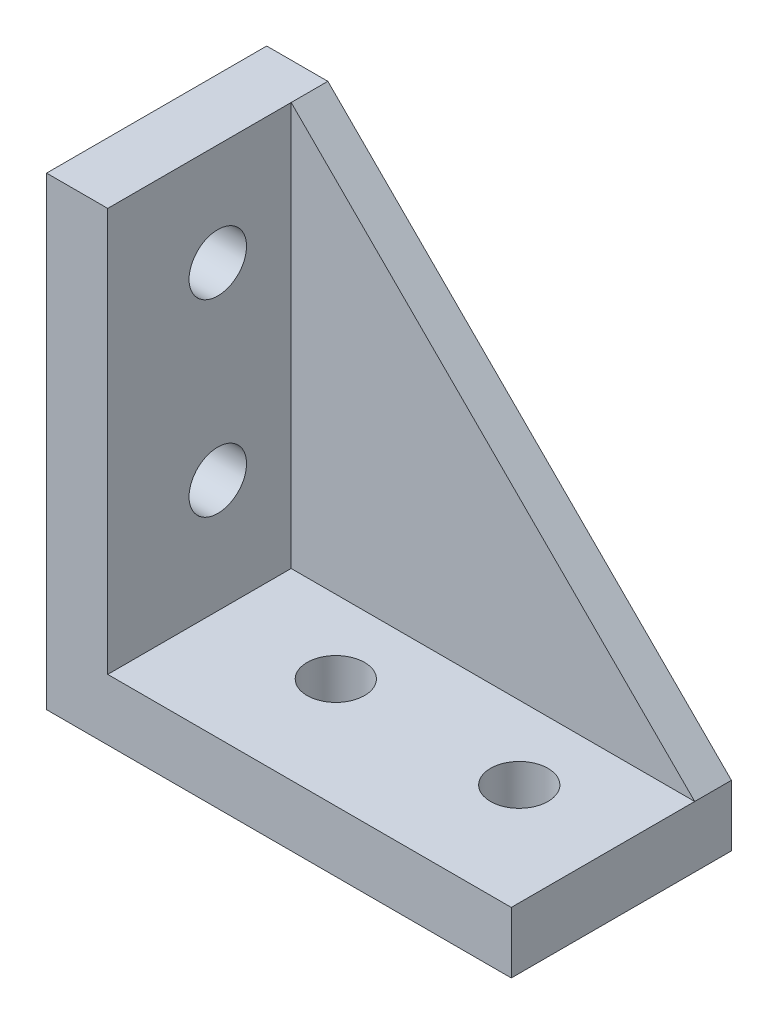
ISO-10303-21;
HEADER;
FILE_DESCRIPTION(('STEP AP214'),'2;1');
FILE_NAME('part.step','',(''),(''),'','','');
FILE_SCHEMA(('AUTOMOTIVE_DESIGN { 1 0 10303 214 1 1 1 1 }'));
ENDSEC;
DATA;
#1=APPLICATION_CONTEXT('core data for automotive mechanical design processes');
#2=APPLICATION_PROTOCOL_DEFINITION('international standard','automotive_design',2000,#1);
#3=PRODUCT_CONTEXT('',#1,'mechanical');
#4=PRODUCT('Part','Part','',(#3));
#5=PRODUCT_RELATED_PRODUCT_CATEGORY('part','',(#4));
#6=PRODUCT_DEFINITION_FORMATION('','',#4);
#7=PRODUCT_DEFINITION_CONTEXT('part definition',#1,'design');
#8=PRODUCT_DEFINITION('design','',#6,#7);
#9=PRODUCT_DEFINITION_SHAPE('','',#8);
#10=(LENGTH_UNIT() NAMED_UNIT(*) SI_UNIT(.MILLI.,.METRE.));
#11=(NAMED_UNIT(*) PLANE_ANGLE_UNIT() SI_UNIT($,.RADIAN.));
#12=(NAMED_UNIT(*) SI_UNIT($,.STERADIAN.) SOLID_ANGLE_UNIT());
#13=UNCERTAINTY_MEASURE_WITH_UNIT(LENGTH_MEASURE(1.E-05),#10,'distance_accuracy_value','');
#14=(GEOMETRIC_REPRESENTATION_CONTEXT(3) GLOBAL_UNCERTAINTY_ASSIGNED_CONTEXT((#13)) GLOBAL_UNIT_ASSIGNED_CONTEXT((#10,
#11,#12)) REPRESENTATION_CONTEXT('',''));
#15=CARTESIAN_POINT('',(0.,0.,0.));
#16=DIRECTION('',(0.,0.,1.));
#17=DIRECTION('',(1.,0.,0.));
#18=AXIS2_PLACEMENT_3D('',#15,#16,#17);
#19=CARTESIAN_POINT('',(5.00000000000001,38.,3.));
#20=DIRECTION('',(-0.707106781186548,-0.707106781186548,0.));
#21=DIRECTION('',(0.707106781186548,-0.707106781186548,0.));
#22=AXIS2_PLACEMENT_3D('',#19,#20,#21);
#23=PLANE('',#22);
#24=DIRECTION('',(-0.707106781186547,0.707106781186547,0.));
#25=VECTOR('',#24,1.);
#26=CARTESIAN_POINT('',(5.00000000000001,38.,0.));
#27=LINE('',#26,#25);
#28=CARTESIAN_POINT('',(38.,5.,0.));
#29=VERTEX_POINT('',#28);
#30=CARTESIAN_POINT('',(5.00000000000001,38.,0.));
#31=VERTEX_POINT('',#30);
#32=EDGE_CURVE('E91',#29,#31,#27,.T.);
#33=ORIENTED_EDGE('',*,*,#32,.T.);
#34=DIRECTION('',(0.,0.,-1.));
#35=VECTOR('',#34,1.);
#36=CARTESIAN_POINT('',(5.00000000000001,38.,3.));
#37=LINE('',#36,#35);
#38=CARTESIAN_POINT('',(5.00000000000001,38.,3.));
#39=VERTEX_POINT('',#38);
#40=EDGE_CURVE('E12',#39,#31,#37,.T.);
#41=ORIENTED_EDGE('',*,*,#40,.F.);
#42=DIRECTION('',(-0.707106781186547,0.707106781186547,0.));
#43=VECTOR('',#42,1.);
#44=CARTESIAN_POINT('',(5.00000000000001,38.,3.));
#45=LINE('',#44,#43);
#46=CARTESIAN_POINT('',(38.,5.,3.));
#47=VERTEX_POINT('',#46);
#48=EDGE_CURVE('E84',#47,#39,#45,.T.);
#49=ORIENTED_EDGE('',*,*,#48,.F.);
#50=DIRECTION('',(0.,0.,-1.));
#51=VECTOR('',#50,1.);
#52=CARTESIAN_POINT('',(38.,5.,3.));
#53=LINE('',#52,#51);
#54=EDGE_CURVE('E92',#47,#29,#53,.T.);
#55=ORIENTED_EDGE('',*,*,#54,.T.);
#56=EDGE_LOOP('',(#33,#41,#49,#55));
#57=FACE_BOUND('',#56,.T.);
#58=ADVANCED_FACE('F44',(#57),#23,.F.);
#59=CARTESIAN_POINT('',(5.00000000000001,5.,3.));
#60=DIRECTION('',(1.,0.,0.));
#61=DIRECTION('',(0.,0.,-1.));
#62=AXIS2_PLACEMENT_3D('',#59,#60,#61);
#63=PLANE('',#62);
#64=DIRECTION('',(0.,-1.,0.));
#65=VECTOR('',#64,1.);
#66=CARTESIAN_POINT('',(5.00000000000001,5.,0.));
#67=LINE('',#66,#65);
#68=CARTESIAN_POINT('',(5.00000000000001,5.,0.));
#69=VERTEX_POINT('',#68);
#70=EDGE_CURVE('E72',#31,#69,#67,.T.);
#71=ORIENTED_EDGE('',*,*,#70,.T.);
#72=DIRECTION('',(0.,0.,-1.));
#73=VECTOR('',#72,1.);
#74=CARTESIAN_POINT('',(5.00000000000001,5.,3.));
#75=LINE('',#74,#73);
#76=CARTESIAN_POINT('',(5.00000000000001,5.,3.));
#77=VERTEX_POINT('',#76);
#78=EDGE_CURVE('E52',#77,#69,#75,.T.);
#79=ORIENTED_EDGE('',*,*,#78,.F.);
#80=DIRECTION('',(0.,-1.,0.));
#81=VECTOR('',#80,1.);
#82=CARTESIAN_POINT('',(5.00000000000001,5.,3.));
#83=LINE('',#82,#81);
#84=EDGE_CURVE('E80',#39,#77,#83,.T.);
#85=ORIENTED_EDGE('',*,*,#84,.F.);
#86=ORIENTED_EDGE('',*,*,#40,.T.);
#87=EDGE_LOOP('',(#71,#79,#85,#86));
#88=FACE_BOUND('',#87,.T.);
#89=ADVANCED_FACE('F81',(#88),#63,.F.);
#90=CARTESIAN_POINT('',(5.00000000000001,5.,3.));
#91=DIRECTION('',(0.,1.,0.));
#92=DIRECTION('',(0.,0.,1.));
#93=AXIS2_PLACEMENT_3D('',#90,#91,#92);
#94=PLANE('',#93);
#95=DIRECTION('',(1.,0.,0.));
#96=VECTOR('',#95,1.);
#97=CARTESIAN_POINT('',(5.00000000000001,5.,0.));
#98=LINE('',#97,#96);
#99=EDGE_CURVE('E77',#69,#29,#98,.T.);
#100=ORIENTED_EDGE('',*,*,#99,.T.);
#101=ORIENTED_EDGE('',*,*,#54,.F.);
#102=DIRECTION('',(1.,0.,0.));
#103=VECTOR('',#102,1.);
#104=CARTESIAN_POINT('',(5.00000000000001,5.,3.));
#105=LINE('',#104,#103);
#106=EDGE_CURVE('E60',#77,#47,#105,.T.);
#107=ORIENTED_EDGE('',*,*,#106,.F.);
#108=ORIENTED_EDGE('',*,*,#78,.T.);
#109=EDGE_LOOP('',(#100,#101,#107,#108));
#110=FACE_BOUND('',#109,.T.);
#111=ADVANCED_FACE('F99',(#110),#94,.F.);
#112=CARTESIAN_POINT('',(0.,0.,3.));
#113=DIRECTION('',(0.,0.,1.));
#114=DIRECTION('',(1.,0.,0.));
#115=AXIS2_PLACEMENT_3D('',#112,#113,#114);
#116=PLANE('',#115);
#117=ORIENTED_EDGE('',*,*,#48,.T.);
#118=ORIENTED_EDGE('',*,*,#84,.T.);
#119=ORIENTED_EDGE('',*,*,#106,.T.);
#120=EDGE_LOOP('',(#117,#118,#119));
#121=FACE_BOUND('',#120,.T.);
#122=ADVANCED_FACE('F87',(#121),#116,.T.);
#123=CARTESIAN_POINT('',(0.,0.,0.));
#124=DIRECTION('',(0.,0.,1.));
#125=DIRECTION('',(1.,0.,0.));
#126=AXIS2_PLACEMENT_3D('',#123,#124,#125);
#127=PLANE('',#126);
#128=ORIENTED_EDGE('',*,*,#32,.F.);
#129=ORIENTED_EDGE('',*,*,#99,.F.);
#130=ORIENTED_EDGE('',*,*,#70,.F.);
#131=EDGE_LOOP('',(#128,#129,#130));
#132=FACE_BOUND('',#131,.T.);
#133=ADVANCED_FACE('F100',(#132),#127,.F.);
#134=CLOSED_SHELL('',(#58,#89,#111,#122,#133));
#135=MANIFOLD_SOLID_BREP('B2',#134);
#136=CARTESIAN_POINT('',(0.,38.,18.));
#137=DIRECTION('',(0.,-1.,0.));
#138=DIRECTION('',(0.,0.,-1.));
#139=AXIS2_PLACEMENT_3D('',#136,#137,#138);
#140=PLANE('',#139);
#141=DIRECTION('',(-1.,0.,0.));
#142=VECTOR('',#141,1.);
#143=CARTESIAN_POINT('',(0.,38.,0.));
#144=LINE('',#143,#142);
#145=CARTESIAN_POINT('',(5.00000000000001,38.,0.));
#146=VERTEX_POINT('',#145);
#147=CARTESIAN_POINT('',(0.,38.,0.));
#148=VERTEX_POINT('',#147);
#149=EDGE_CURVE('E230',#146,#148,#144,.T.);
#150=ORIENTED_EDGE('',*,*,#149,.T.);
#151=DIRECTION('',(0.,0.,-1.));
#152=VECTOR('',#151,1.);
#153=CARTESIAN_POINT('',(0.,38.,18.));
#154=LINE('',#153,#152);
#155=CARTESIAN_POINT('',(0.,38.,18.));
#156=VERTEX_POINT('',#155);
#157=EDGE_CURVE('E42',#156,#148,#154,.T.);
#158=ORIENTED_EDGE('',*,*,#157,.F.);
#159=DIRECTION('',(-1.,0.,0.));
#160=VECTOR('',#159,1.);
#161=CARTESIAN_POINT('',(0.,38.,18.));
#162=LINE('',#161,#160);
#163=CARTESIAN_POINT('',(5.00000000000001,38.,18.));
#164=VERTEX_POINT('',#163);
#165=EDGE_CURVE('E241',#164,#156,#162,.T.);
#166=ORIENTED_EDGE('',*,*,#165,.F.);
#167=DIRECTION('',(0.,0.,-1.));
#168=VECTOR('',#167,1.);
#169=CARTESIAN_POINT('',(5.00000000000001,38.,18.));
#170=LINE('',#169,#168);
#171=EDGE_CURVE('E226',#164,#146,#170,.T.);
#172=ORIENTED_EDGE('',*,*,#171,.T.);
#173=EDGE_LOOP('',(#150,#158,#166,#172));
#174=FACE_BOUND('',#173,.T.);
#175=ADVANCED_FACE('F144',(#174),#140,.F.);
#176=CARTESIAN_POINT('',(0.,38.,18.));
#177=DIRECTION('',(1.,0.,0.));
#178=DIRECTION('',(0.,1.,0.));
#179=AXIS2_PLACEMENT_3D('',#176,#177,#178);
#180=PLANE('',#179);
#181=CARTESIAN_POINT('',(0.,14.25,9.));
#182=DIRECTION('',(1.,0.,0.));
#183=DIRECTION('',(0.,1.,0.));
#184=AXIS2_PLACEMENT_3D('',#181,#182,#183);
#185=CIRCLE('',#184,2.35);
#186=CARTESIAN_POINT('',(0.,16.6,9.));
#187=VERTEX_POINT('',#186);
#188=EDGE_CURVE('E234',#187,#187,#185,.F.);
#189=ORIENTED_EDGE('',*,*,#188,.F.);
#190=EDGE_LOOP('',(#189));
#191=FACE_BOUND('',#190,.T.);
#192=CARTESIAN_POINT('',(0.,29.65,9.));
#193=DIRECTION('',(1.,0.,0.));
#194=DIRECTION('',(0.,1.,0.));
#195=AXIS2_PLACEMENT_3D('',#192,#193,#194);
#196=CIRCLE('',#195,2.35);
#197=CARTESIAN_POINT('',(0.,32.,9.));
#198=VERTEX_POINT('',#197);
#199=EDGE_CURVE('E250',#198,#198,#196,.F.);
#200=ORIENTED_EDGE('',*,*,#199,.F.);
#201=EDGE_LOOP('',(#200));
#202=FACE_BOUND('',#201,.T.);
#203=DIRECTION('',(0.,-1.,0.));
#204=VECTOR('',#203,1.);
#205=CARTESIAN_POINT('',(0.,38.,0.));
#206=LINE('',#205,#204);
#207=CARTESIAN_POINT('',(0.,0.,0.));
#208=VERTEX_POINT('',#207);
#209=EDGE_CURVE('E233',#148,#208,#206,.T.);
#210=ORIENTED_EDGE('',*,*,#209,.T.);
#211=DIRECTION('',(0.,0.,-1.));
#212=VECTOR('',#211,1.);
#213=CARTESIAN_POINT('',(0.,0.,18.));
#214=LINE('',#213,#212);
#215=CARTESIAN_POINT('',(0.,0.,18.));
#216=VERTEX_POINT('',#215);
#217=EDGE_CURVE('E153',#216,#208,#214,.T.);
#218=ORIENTED_EDGE('',*,*,#217,.F.);
#219=DIRECTION('',(0.,-1.,0.));
#220=VECTOR('',#219,1.);
#221=CARTESIAN_POINT('',(0.,38.,18.));
#222=LINE('',#221,#220);
#223=EDGE_CURVE('E199',#156,#216,#222,.T.);
#224=ORIENTED_EDGE('',*,*,#223,.F.);
#225=ORIENTED_EDGE('',*,*,#157,.T.);
#226=EDGE_LOOP('',(#210,#218,#224,#225));
#227=FACE_BOUND('',#226,.T.);
#228=ADVANCED_FACE('F274',(#191,#202,#227),#180,.F.);
#229=CARTESIAN_POINT('',(0.,0.,18.));
#230=DIRECTION('',(0.,1.,0.));
#231=DIRECTION('',(0.,0.,1.));
#232=AXIS2_PLACEMENT_3D('',#229,#230,#231);
#233=PLANE('',#232);
#234=CARTESIAN_POINT('',(29.65,0.,9.));
#235=DIRECTION('',(0.,1.,0.));
#236=DIRECTION('',(0.,0.,1.));
#237=AXIS2_PLACEMENT_3D('',#234,#235,#236);
#238=CIRCLE('',#237,2.35);
#239=CARTESIAN_POINT('',(29.65,0.,11.35));
#240=VERTEX_POINT('',#239);
#241=EDGE_CURVE('E251',#240,#240,#238,.F.);
#242=ORIENTED_EDGE('',*,*,#241,.F.);
#243=EDGE_LOOP('',(#242));
#244=FACE_BOUND('',#243,.T.);
#245=CARTESIAN_POINT('',(14.65,0.,9.));
#246=DIRECTION('',(0.,1.,0.));
#247=DIRECTION('',(0.,0.,1.));
#248=AXIS2_PLACEMENT_3D('',#245,#246,#247);
#249=CIRCLE('',#248,2.35);
#250=CARTESIAN_POINT('',(14.65,0.,11.35));
#251=VERTEX_POINT('',#250);
#252=EDGE_CURVE('E256',#251,#251,#249,.F.);
#253=ORIENTED_EDGE('',*,*,#252,.F.);
#254=EDGE_LOOP('',(#253));
#255=FACE_BOUND('',#254,.T.);
#256=DIRECTION('',(1.,0.,0.));
#257=VECTOR('',#256,1.);
#258=CARTESIAN_POINT('',(0.,0.,0.));
#259=LINE('',#258,#257);
#260=CARTESIAN_POINT('',(38.,0.,0.));
#261=VERTEX_POINT('',#260);
#262=EDGE_CURVE('E236',#208,#261,#259,.T.);
#263=ORIENTED_EDGE('',*,*,#262,.T.);
#264=DIRECTION('',(0.,0.,-1.));
#265=VECTOR('',#264,1.);
#266=CARTESIAN_POINT('',(38.,0.,18.));
#267=LINE('',#266,#265);
#268=CARTESIAN_POINT('',(38.,0.,18.));
#269=VERTEX_POINT('',#268);
#270=EDGE_CURVE('E221',#269,#261,#267,.T.);
#271=ORIENTED_EDGE('',*,*,#270,.F.);
#272=DIRECTION('',(1.,0.,0.));
#273=VECTOR('',#272,1.);
#274=CARTESIAN_POINT('',(0.,0.,18.));
#275=LINE('',#274,#273);
#276=EDGE_CURVE('E212',#216,#269,#275,.T.);
#277=ORIENTED_EDGE('',*,*,#276,.F.);
#278=ORIENTED_EDGE('',*,*,#217,.T.);
#279=EDGE_LOOP('',(#263,#271,#277,#278));
#280=FACE_BOUND('',#279,.T.);
#281=ADVANCED_FACE('F277',(#244,#255,#280),#233,.F.);
#282=CARTESIAN_POINT('',(38.,0.,18.));
#283=DIRECTION('',(-1.,0.,0.));
#284=DIRECTION('',(0.,0.,1.));
#285=AXIS2_PLACEMENT_3D('',#282,#283,#284);
#286=PLANE('',#285);
#287=DIRECTION('',(0.,1.,0.));
#288=VECTOR('',#287,1.);
#289=CARTESIAN_POINT('',(38.,0.,0.));
#290=LINE('',#289,#288);
#291=CARTESIAN_POINT('',(38.,5.,0.));
#292=VERTEX_POINT('',#291);
#293=EDGE_CURVE('E220',#261,#292,#290,.T.);
#294=ORIENTED_EDGE('',*,*,#293,.T.);
#295=DIRECTION('',(0.,0.,-1.));
#296=VECTOR('',#295,1.);
#297=CARTESIAN_POINT('',(38.,5.,18.));
#298=LINE('',#297,#296);
#299=CARTESIAN_POINT('',(38.,5.,18.));
#300=VERTEX_POINT('',#299);
#301=EDGE_CURVE('E217',#300,#292,#298,.T.);
#302=ORIENTED_EDGE('',*,*,#301,.F.);
#303=DIRECTION('',(0.,1.,0.));
#304=VECTOR('',#303,1.);
#305=CARTESIAN_POINT('',(38.,0.,18.));
#306=LINE('',#305,#304);
#307=EDGE_CURVE('E206',#269,#300,#306,.T.);
#308=ORIENTED_EDGE('',*,*,#307,.F.);
#309=ORIENTED_EDGE('',*,*,#270,.T.);
#310=EDGE_LOOP('',(#294,#302,#308,#309));
#311=FACE_BOUND('',#310,.T.);
#312=ADVANCED_FACE('F218',(#311),#286,.F.);
#313=CARTESIAN_POINT('',(38.,5.,18.));
#314=DIRECTION('',(0.,-1.,0.));
#315=DIRECTION('',(0.,0.,-1.));
#316=AXIS2_PLACEMENT_3D('',#313,#314,#315);
#317=PLANE('',#316);
#318=CARTESIAN_POINT('',(29.65,5.,9.));
#319=DIRECTION('',(0.,-1.,0.));
#320=DIRECTION('',(0.,0.,-1.));
#321=AXIS2_PLACEMENT_3D('',#318,#319,#320);
#322=CIRCLE('',#321,2.35);
#323=CARTESIAN_POINT('',(29.65,5.,6.65));
#324=VERTEX_POINT('',#323);
#325=EDGE_CURVE('E147',#324,#324,#322,.F.);
#326=ORIENTED_EDGE('',*,*,#325,.F.);
#327=EDGE_LOOP('',(#326));
#328=FACE_BOUND('',#327,.T.);
#329=CARTESIAN_POINT('',(14.65,5.,9.));
#330=DIRECTION('',(0.,-1.,0.));
#331=DIRECTION('',(0.,0.,-1.));
#332=AXIS2_PLACEMENT_3D('',#329,#330,#331);
#333=CIRCLE('',#332,2.35);
#334=CARTESIAN_POINT('',(14.65,5.,6.65));
#335=VERTEX_POINT('',#334);
#336=EDGE_CURVE('E254',#335,#335,#333,.F.);
#337=ORIENTED_EDGE('',*,*,#336,.F.);
#338=EDGE_LOOP('',(#337));
#339=FACE_BOUND('',#338,.T.);
#340=DIRECTION('',(-1.,0.,0.));
#341=VECTOR('',#340,1.);
#342=CARTESIAN_POINT('',(38.,5.,0.));
#343=LINE('',#342,#341);
#344=CARTESIAN_POINT('',(5.00000000000001,5.,0.));
#345=VERTEX_POINT('',#344);
#346=EDGE_CURVE('E185',#292,#345,#343,.T.);
#347=ORIENTED_EDGE('',*,*,#346,.T.);
#348=DIRECTION('',(0.,0.,-1.));
#349=VECTOR('',#348,1.);
#350=CARTESIAN_POINT('',(5.00000000000001,5.,18.));
#351=LINE('',#350,#349);
#352=CARTESIAN_POINT('',(5.00000000000001,5.,18.));
#353=VERTEX_POINT('',#352);
#354=EDGE_CURVE('E222',#353,#345,#351,.T.);
#355=ORIENTED_EDGE('',*,*,#354,.F.);
#356=DIRECTION('',(-1.,0.,0.));
#357=VECTOR('',#356,1.);
#358=CARTESIAN_POINT('',(38.,5.,18.));
#359=LINE('',#358,#357);
#360=EDGE_CURVE('E210',#300,#353,#359,.T.);
#361=ORIENTED_EDGE('',*,*,#360,.F.);
#362=ORIENTED_EDGE('',*,*,#301,.T.);
#363=EDGE_LOOP('',(#347,#355,#361,#362));
#364=FACE_BOUND('',#363,.T.);
#365=ADVANCED_FACE('F224',(#328,#339,#364),#317,.F.);
#366=CARTESIAN_POINT('',(5.00000000000001,5.,18.));
#367=DIRECTION('',(-1.,0.,0.));
#368=DIRECTION('',(0.,0.,1.));
#369=AXIS2_PLACEMENT_3D('',#366,#367,#368);
#370=PLANE('',#369);
#371=CARTESIAN_POINT('',(5.00000000000001,14.25,9.));
#372=DIRECTION('',(-1.,0.,0.));
#373=DIRECTION('',(0.,0.,1.));
#374=AXIS2_PLACEMENT_3D('',#371,#372,#373);
#375=CIRCLE('',#374,2.35);
#376=CARTESIAN_POINT('',(5.00000000000001,14.25,11.35));
#377=VERTEX_POINT('',#376);
#378=EDGE_CURVE('E252',#377,#377,#375,.F.);
#379=ORIENTED_EDGE('',*,*,#378,.F.);
#380=EDGE_LOOP('',(#379));
#381=FACE_BOUND('',#380,.T.);
#382=CARTESIAN_POINT('',(5.00000000000001,29.65,9.));
#383=DIRECTION('',(-1.,0.,0.));
#384=DIRECTION('',(0.,0.,1.));
#385=AXIS2_PLACEMENT_3D('',#382,#383,#384);
#386=CIRCLE('',#385,2.35);
#387=CARTESIAN_POINT('',(5.00000000000001,29.65,11.35));
#388=VERTEX_POINT('',#387);
#389=EDGE_CURVE('E247',#388,#388,#386,.F.);
#390=ORIENTED_EDGE('',*,*,#389,.F.);
#391=EDGE_LOOP('',(#390));
#392=FACE_BOUND('',#391,.T.);
#393=DIRECTION('',(0.,1.,0.));
#394=VECTOR('',#393,1.);
#395=CARTESIAN_POINT('',(5.00000000000001,5.,0.));
#396=LINE('',#395,#394);
#397=EDGE_CURVE('E191',#345,#146,#396,.T.);
#398=ORIENTED_EDGE('',*,*,#397,.T.);
#399=ORIENTED_EDGE('',*,*,#171,.F.);
#400=DIRECTION('',(0.,1.,0.));
#401=VECTOR('',#400,1.);
#402=CARTESIAN_POINT('',(5.00000000000001,5.,18.));
#403=LINE('',#402,#401);
#404=EDGE_CURVE('E162',#353,#164,#403,.T.);
#405=ORIENTED_EDGE('',*,*,#404,.F.);
#406=ORIENTED_EDGE('',*,*,#354,.T.);
#407=EDGE_LOOP('',(#398,#399,#405,#406));
#408=FACE_BOUND('',#407,.T.);
#409=ADVANCED_FACE('F282',(#381,#392,#408),#370,.F.);
#410=CARTESIAN_POINT('',(0.,0.,18.));
#411=DIRECTION('',(0.,0.,1.));
#412=DIRECTION('',(1.,0.,0.));
#413=AXIS2_PLACEMENT_3D('',#410,#411,#412);
#414=PLANE('',#413);
#415=ORIENTED_EDGE('',*,*,#165,.T.);
#416=ORIENTED_EDGE('',*,*,#223,.T.);
#417=ORIENTED_EDGE('',*,*,#276,.T.);
#418=ORIENTED_EDGE('',*,*,#307,.T.);
#419=ORIENTED_EDGE('',*,*,#360,.T.);
#420=ORIENTED_EDGE('',*,*,#404,.T.);
#421=EDGE_LOOP('',(#415,#416,#417,#418,#419,#420));
#422=FACE_BOUND('',#421,.T.);
#423=ADVANCED_FACE('F208',(#422),#414,.T.);
#424=CARTESIAN_POINT('',(0.,0.,0.));
#425=DIRECTION('',(0.,0.,1.));
#426=DIRECTION('',(1.,0.,0.));
#427=AXIS2_PLACEMENT_3D('',#424,#425,#426);
#428=PLANE('',#427);
#429=ORIENTED_EDGE('',*,*,#149,.F.);
#430=ORIENTED_EDGE('',*,*,#397,.F.);
#431=ORIENTED_EDGE('',*,*,#346,.F.);
#432=ORIENTED_EDGE('',*,*,#293,.F.);
#433=ORIENTED_EDGE('',*,*,#262,.F.);
#434=ORIENTED_EDGE('',*,*,#209,.F.);
#435=EDGE_LOOP('',(#429,#430,#431,#432,#433,#434));
#436=FACE_BOUND('',#435,.T.);
#437=ADVANCED_FACE('F280',(#436),#428,.F.);
#438=CARTESIAN_POINT('',(17.,29.65,9.));
#439=DIRECTION('',(-1.,0.,0.));
#440=DIRECTION('',(0.,0.,1.));
#441=AXIS2_PLACEMENT_3D('',#438,#439,#440);
#442=CYLINDRICAL_SURFACE('',#441,2.35);
#443=ORIENTED_EDGE('',*,*,#389,.T.);
#444=EDGE_LOOP('',(#443));
#445=FACE_BOUND('',#444,.T.);
#446=ORIENTED_EDGE('',*,*,#199,.T.);
#447=EDGE_LOOP('',(#446));
#448=FACE_BOUND('',#447,.T.);
#449=ADVANCED_FACE('F352',(#445,#448),#442,.F.);
#450=CARTESIAN_POINT('',(17.,14.25,9.));
#451=DIRECTION('',(-1.,0.,0.));
#452=DIRECTION('',(0.,0.,1.));
#453=AXIS2_PLACEMENT_3D('',#450,#451,#452);
#454=CYLINDRICAL_SURFACE('',#453,2.35);
#455=ORIENTED_EDGE('',*,*,#378,.T.);
#456=EDGE_LOOP('',(#455));
#457=FACE_BOUND('',#456,.T.);
#458=ORIENTED_EDGE('',*,*,#188,.T.);
#459=EDGE_LOOP('',(#458));
#460=FACE_BOUND('',#459,.T.);
#461=ADVANCED_FACE('F334',(#457,#460),#454,.F.);
#462=CARTESIAN_POINT('',(14.65,20.,9.));
#463=DIRECTION('',(0.,-1.,0.));
#464=DIRECTION('',(0.,0.,-1.));
#465=AXIS2_PLACEMENT_3D('',#462,#463,#464);
#466=CYLINDRICAL_SURFACE('',#465,2.35);
#467=ORIENTED_EDGE('',*,*,#336,.T.);
#468=EDGE_LOOP('',(#467));
#469=FACE_BOUND('',#468,.T.);
#470=ORIENTED_EDGE('',*,*,#252,.T.);
#471=EDGE_LOOP('',(#470));
#472=FACE_BOUND('',#471,.T.);
#473=ADVANCED_FACE('F328',(#469,#472),#466,.F.);
#474=CARTESIAN_POINT('',(29.65,20.,9.));
#475=DIRECTION('',(0.,-1.,0.));
#476=DIRECTION('',(0.,0.,-1.));
#477=AXIS2_PLACEMENT_3D('',#474,#475,#476);
#478=CYLINDRICAL_SURFACE('',#477,2.35);
#479=ORIENTED_EDGE('',*,*,#325,.T.);
#480=EDGE_LOOP('',(#479));
#481=FACE_BOUND('',#480,.T.);
#482=ORIENTED_EDGE('',*,*,#241,.T.);
#483=EDGE_LOOP('',(#482));
#484=FACE_BOUND('',#483,.T.);
#485=ADVANCED_FACE('F333',(#481,#484),#478,.F.);
#486=CLOSED_SHELL('',(#175,#228,#281,#312,#365,#409,#423,#437,#449,#461,#473,#485));
#487=MANIFOLD_SOLID_BREP('B6',#486);
#488=ADVANCED_BREP_SHAPE_REPRESENTATION('',(#18,#135,#487),#14);
#489=SHAPE_DEFINITION_REPRESENTATION(#9,#488);
ENDSEC;
END-ISO-10303-21;
